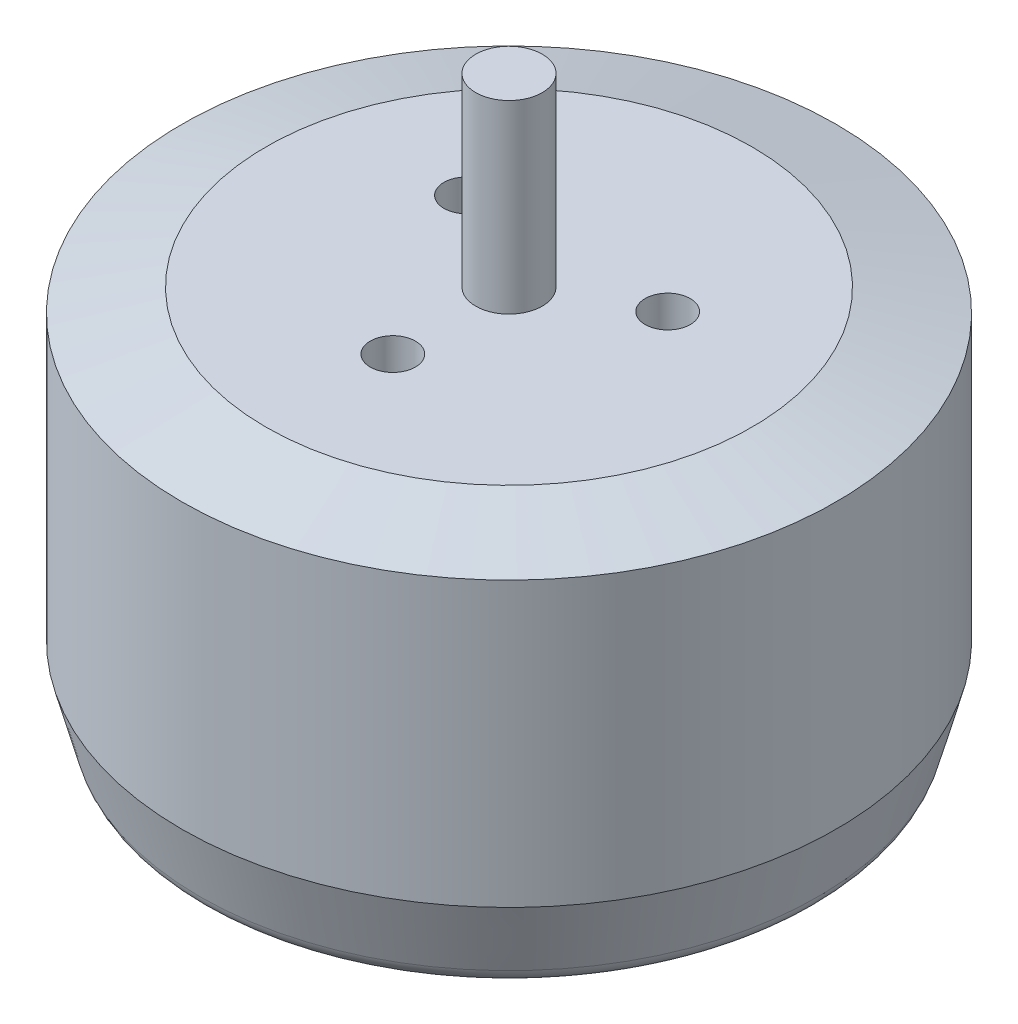
ISO-10303-21;
HEADER;
FILE_DESCRIPTION(('STEP AP214'),'2;1');
FILE_NAME('part.step','',(''),(''),'','','');
FILE_SCHEMA(('AUTOMOTIVE_DESIGN { 1 0 10303 214 1 1 1 1 }'));
ENDSEC;
DATA;
#1=APPLICATION_CONTEXT('core data for automotive mechanical design processes');
#2=APPLICATION_PROTOCOL_DEFINITION('international standard','automotive_design',2000,#1);
#3=PRODUCT_CONTEXT('',#1,'mechanical');
#4=PRODUCT('Part','Part','',(#3));
#5=PRODUCT_RELATED_PRODUCT_CATEGORY('part','',(#4));
#6=PRODUCT_DEFINITION_FORMATION('','',#4);
#7=PRODUCT_DEFINITION_CONTEXT('part definition',#1,'design');
#8=PRODUCT_DEFINITION('design','',#6,#7);
#9=PRODUCT_DEFINITION_SHAPE('','',#8);
#10=(LENGTH_UNIT() NAMED_UNIT(*) SI_UNIT(.MILLI.,.METRE.));
#11=(NAMED_UNIT(*) PLANE_ANGLE_UNIT() SI_UNIT($,.RADIAN.));
#12=(NAMED_UNIT(*) SI_UNIT($,.STERADIAN.) SOLID_ANGLE_UNIT());
#13=UNCERTAINTY_MEASURE_WITH_UNIT(LENGTH_MEASURE(1.E-05),#10,'distance_accuracy_value','');
#14=(GEOMETRIC_REPRESENTATION_CONTEXT(3) GLOBAL_UNCERTAINTY_ASSIGNED_CONTEXT((#13)) GLOBAL_UNIT_ASSIGNED_CONTEXT((#10,
#11,#12)) REPRESENTATION_CONTEXT('',''));
#15=CARTESIAN_POINT('',(0.,0.,0.));
#16=DIRECTION('',(0.,0.,1.));
#17=DIRECTION('',(1.,0.,0.));
#18=AXIS2_PLACEMENT_3D('',#15,#16,#17);
#19=CARTESIAN_POINT('',(0.,17.3,0.));
#20=DIRECTION('',(0.,-1.,0.));
#21=DIRECTION('',(0.,0.,-1.));
#22=AXIS2_PLACEMENT_3D('',#19,#20,#21);
#23=CYLINDRICAL_SURFACE('',#22,14.5);
#24=CARTESIAN_POINT('',(0.,16.3,0.));
#25=DIRECTION('',(0.,1.,0.));
#26=DIRECTION('',(0.,0.,1.));
#27=AXIS2_PLACEMENT_3D('',#24,#25,#26);
#28=CIRCLE('',#27,14.5);
#29=CARTESIAN_POINT('',(0.,16.3,14.5));
#30=VERTEX_POINT('',#29);
#31=EDGE_CURVE('E11',#30,#30,#28,.F.);
#32=ORIENTED_EDGE('',*,*,#31,.T.);
#33=EDGE_LOOP('',(#32));
#34=FACE_BOUND('',#33,.T.);
#35=CARTESIAN_POINT('',(0.,3.73205080756882,0.));
#36=DIRECTION('',(0.,1.,0.));
#37=DIRECTION('',(0.,0.,1.));
#38=AXIS2_PLACEMENT_3D('',#35,#36,#37);
#39=CIRCLE('',#38,14.5);
#40=CARTESIAN_POINT('',(0.,3.73205080756882,14.5));
#41=VERTEX_POINT('',#40);
#42=EDGE_CURVE('E121',#41,#41,#39,.T.);
#43=ORIENTED_EDGE('',*,*,#42,.T.);
#44=EDGE_LOOP('',(#43));
#45=FACE_BOUND('',#44,.T.);
#46=ADVANCED_FACE('F36',(#34,#45),#23,.T.);
#47=CARTESIAN_POINT('',(0.,17.3,0.));
#48=DIRECTION('',(0.,1.,0.));
#49=DIRECTION('',(0.,0.,1.));
#50=AXIS2_PLACEMENT_3D('',#47,#48,#49);
#51=PLANE('',#50);
#52=CARTESIAN_POINT('',(-4.46003082948985,17.3,-2.57500000000002));
#53=DIRECTION('',(0.,1.,0.));
#54=DIRECTION('',(0.,0.,1.));
#55=AXIS2_PLACEMENT_3D('',#52,#53,#54);
#56=CIRCLE('',#55,1.);
#57=CARTESIAN_POINT('',(-4.46003082948985,17.3,-1.57500000000002));
#58=VERTEX_POINT('',#57);
#59=EDGE_CURVE('E77',#58,#58,#56,.T.);
#60=ORIENTED_EDGE('',*,*,#59,.F.);
#61=EDGE_LOOP('',(#60));
#62=FACE_BOUND('',#61,.T.);
#63=CARTESIAN_POINT('',(4.46003082948985,17.3,-2.57500000000002));
#64=DIRECTION('',(0.,1.,0.));
#65=DIRECTION('',(0.,0.,1.));
#66=AXIS2_PLACEMENT_3D('',#63,#64,#65);
#67=CIRCLE('',#66,0.999999999999999);
#68=CARTESIAN_POINT('',(4.46003082948985,17.3,-1.57500000000002));
#69=VERTEX_POINT('',#68);
#70=EDGE_CURVE('E76',#69,#69,#67,.T.);
#71=ORIENTED_EDGE('',*,*,#70,.F.);
#72=EDGE_LOOP('',(#71));
#73=FACE_BOUND('',#72,.T.);
#74=CARTESIAN_POINT('',(0.,17.3,5.15));
#75=DIRECTION('',(0.,1.,0.));
#76=DIRECTION('',(0.,0.,1.));
#77=AXIS2_PLACEMENT_3D('',#74,#75,#76);
#78=CIRCLE('',#77,1.);
#79=CARTESIAN_POINT('',(0.,17.3,6.15));
#80=VERTEX_POINT('',#79);
#81=EDGE_CURVE('E87',#80,#80,#78,.T.);
#82=ORIENTED_EDGE('',*,*,#81,.F.);
#83=EDGE_LOOP('',(#82));
#84=FACE_BOUND('',#83,.T.);
#85=CARTESIAN_POINT('',(0.,17.3,0.));
#86=DIRECTION('',(0.,1.,0.));
#87=DIRECTION('',(0.,0.,1.));
#88=AXIS2_PLACEMENT_3D('',#85,#86,#87);
#89=CIRCLE('',#88,10.7679491924311);
#90=CARTESIAN_POINT('',(0.,17.3,10.7679491924311));
#91=VERTEX_POINT('',#90);
#92=EDGE_CURVE('E44',#91,#91,#89,.T.);
#93=ORIENTED_EDGE('',*,*,#92,.T.);
#94=EDGE_LOOP('',(#93));
#95=FACE_BOUND('',#94,.T.);
#96=CARTESIAN_POINT('',(0.,17.3,0.));
#97=DIRECTION('',(0.,1.,0.));
#98=DIRECTION('',(0.,0.,1.));
#99=AXIS2_PLACEMENT_3D('',#96,#97,#98);
#100=CIRCLE('',#99,1.475);
#101=CARTESIAN_POINT('',(0.,17.3,1.475));
#102=VERTEX_POINT('',#101);
#103=EDGE_CURVE('E117',#102,#102,#100,.T.);
#104=ORIENTED_EDGE('',*,*,#103,.F.);
#105=EDGE_LOOP('',(#104));
#106=FACE_BOUND('',#105,.T.);
#107=ADVANCED_FACE('F134',(#62,#73,#84,#95,#106),#51,.T.);
#108=CARTESIAN_POINT('',(0.,0.,0.));
#109=DIRECTION('',(0.,1.,0.));
#110=DIRECTION('',(0.,0.,1.));
#111=AXIS2_PLACEMENT_3D('',#108,#109,#110);
#112=PLANE('',#111);
#113=CARTESIAN_POINT('',(0.,0.,0.));
#114=DIRECTION('',(0.,1.,0.));
#115=DIRECTION('',(0.,0.,1.));
#116=AXIS2_PLACEMENT_3D('',#113,#114,#115);
#117=CIRCLE('',#116,12.732673012021);
#118=CARTESIAN_POINT('',(0.,0.,12.732673012021));
#119=VERTEX_POINT('',#118);
#120=EDGE_CURVE('E126',#119,#119,#117,.F.);
#121=ORIENTED_EDGE('',*,*,#120,.T.);
#122=EDGE_LOOP('',(#121));
#123=FACE_BOUND('',#122,.T.);
#124=CARTESIAN_POINT('',(0.,0.,8.));
#125=DIRECTION('',(0.,-1.,0.));
#126=DIRECTION('',(0.,0.,-1.));
#127=AXIS2_PLACEMENT_3D('',#124,#125,#126);
#128=CIRCLE('',#127,1.49999999999999);
#129=CARTESIAN_POINT('',(0.,0.,6.50000000000001));
#130=VERTEX_POINT('',#129);
#131=EDGE_CURVE('E93',#130,#130,#128,.T.);
#132=ORIENTED_EDGE('',*,*,#131,.F.);
#133=EDGE_LOOP('',(#132));
#134=FACE_BOUND('',#133,.T.);
#135=CARTESIAN_POINT('',(-9.5,0.,0.));
#136=DIRECTION('',(0.,-1.,0.));
#137=DIRECTION('',(0.,0.,-1.));
#138=AXIS2_PLACEMENT_3D('',#135,#136,#137);
#139=CIRCLE('',#138,1.49999999999999);
#140=CARTESIAN_POINT('',(-9.5,0.,-1.49999999999999));
#141=VERTEX_POINT('',#140);
#142=EDGE_CURVE('E99',#141,#141,#139,.T.);
#143=ORIENTED_EDGE('',*,*,#142,.F.);
#144=EDGE_LOOP('',(#143));
#145=FACE_BOUND('',#144,.T.);
#146=CARTESIAN_POINT('',(0.,0.,-8.00063569577454));
#147=DIRECTION('',(0.,-1.,0.));
#148=DIRECTION('',(0.,0.,-1.));
#149=AXIS2_PLACEMENT_3D('',#146,#147,#148);
#150=CIRCLE('',#149,1.49999999999999);
#151=CARTESIAN_POINT('',(0.,0.,-9.50063569577453));
#152=VERTEX_POINT('',#151);
#153=EDGE_CURVE('E105',#152,#152,#150,.T.);
#154=ORIENTED_EDGE('',*,*,#153,.F.);
#155=EDGE_LOOP('',(#154));
#156=FACE_BOUND('',#155,.T.);
#157=CARTESIAN_POINT('',(9.5,0.,0.));
#158=DIRECTION('',(0.,-1.,0.));
#159=DIRECTION('',(0.,0.,-1.));
#160=AXIS2_PLACEMENT_3D('',#157,#158,#159);
#161=CIRCLE('',#160,1.49999999999999);
#162=CARTESIAN_POINT('',(9.5,0.,-1.49999999999999));
#163=VERTEX_POINT('',#162);
#164=EDGE_CURVE('E111',#163,#163,#161,.T.);
#165=ORIENTED_EDGE('',*,*,#164,.F.);
#166=EDGE_LOOP('',(#165));
#167=FACE_BOUND('',#166,.T.);
#168=ADVANCED_FACE('F157',(#123,#134,#145,#156,#167),#112,.F.);
#169=CARTESIAN_POINT('',(0.,25.5,0.));
#170=DIRECTION('',(0.,-1.,0.));
#171=DIRECTION('',(0.,0.,-1.));
#172=AXIS2_PLACEMENT_3D('',#169,#170,#171);
#173=CYLINDRICAL_SURFACE('',#172,1.475);
#174=CARTESIAN_POINT('',(0.,25.5,0.));
#175=DIRECTION('',(0.,1.,0.));
#176=DIRECTION('',(0.,0.,1.));
#177=AXIS2_PLACEMENT_3D('',#174,#175,#176);
#178=CIRCLE('',#177,1.475);
#179=CARTESIAN_POINT('',(0.,25.5,1.475));
#180=VERTEX_POINT('',#179);
#181=EDGE_CURVE('E118',#180,#180,#178,.T.);
#182=ORIENTED_EDGE('',*,*,#181,.F.);
#183=EDGE_LOOP('',(#182));
#184=FACE_BOUND('',#183,.T.);
#185=ORIENTED_EDGE('',*,*,#103,.T.);
#186=EDGE_LOOP('',(#185));
#187=FACE_BOUND('',#186,.T.);
#188=ADVANCED_FACE('F180',(#184,#187),#173,.T.);
#189=CARTESIAN_POINT('',(0.,25.5,0.));
#190=DIRECTION('',(0.,1.,0.));
#191=DIRECTION('',(0.,0.,1.));
#192=AXIS2_PLACEMENT_3D('',#189,#190,#191);
#193=PLANE('',#192);
#194=ORIENTED_EDGE('',*,*,#181,.T.);
#195=EDGE_LOOP('',(#194));
#196=FACE_BOUND('',#195,.T.);
#197=ADVANCED_FACE('F201',(#196),#193,.T.);
#198=CARTESIAN_POINT('',(9.5,3.,0.));
#199=DIRECTION('',(0.,-1.,0.));
#200=DIRECTION('',(0.,0.,-1.));
#201=AXIS2_PLACEMENT_3D('',#198,#199,#200);
#202=CONICAL_SURFACE('',#201,1.49999999999999,1.02974425867665);
#203=CARTESIAN_POINT('',(9.5,3.90129092854134,0.));
#204=VERTEX_POINT('',#203);
#205=VERTEX_LOOP('',#204);
#206=FACE_BOUND('',#205,.T.);
#207=CARTESIAN_POINT('',(9.5,3.,0.));
#208=DIRECTION('',(0.,-1.,0.));
#209=DIRECTION('',(0.,0.,-1.));
#210=AXIS2_PLACEMENT_3D('',#207,#208,#209);
#211=CIRCLE('',#210,1.49999999999999);
#212=CARTESIAN_POINT('',(9.5,3.,-1.49999999999999));
#213=VERTEX_POINT('',#212);
#214=EDGE_CURVE('E114',#213,#213,#211,.T.);
#215=ORIENTED_EDGE('',*,*,#214,.T.);
#216=EDGE_LOOP('',(#215));
#217=FACE_BOUND('',#216,.T.);
#218=ADVANCED_FACE('F192',(#206,#217),#202,.F.);
#219=CARTESIAN_POINT('',(9.5,0.,0.));
#220=DIRECTION('',(0.,-1.,0.));
#221=DIRECTION('',(0.,0.,-1.));
#222=AXIS2_PLACEMENT_3D('',#219,#220,#221);
#223=CYLINDRICAL_SURFACE('',#222,1.49999999999999);
#224=ORIENTED_EDGE('',*,*,#214,.F.);
#225=EDGE_LOOP('',(#224));
#226=FACE_BOUND('',#225,.T.);
#227=ORIENTED_EDGE('',*,*,#164,.T.);
#228=EDGE_LOOP('',(#227));
#229=FACE_BOUND('',#228,.T.);
#230=ADVANCED_FACE('F189',(#226,#229),#223,.F.);
#231=CARTESIAN_POINT('',(0.,3.,-8.00063569577454));
#232=DIRECTION('',(0.,-1.,0.));
#233=DIRECTION('',(0.,0.,-1.));
#234=AXIS2_PLACEMENT_3D('',#231,#232,#233);
#235=CONICAL_SURFACE('',#234,1.49999999999999,1.02974425867665);
#236=CARTESIAN_POINT('',(0.,3.90129092854134,-8.00063569577454));
#237=VERTEX_POINT('',#236);
#238=VERTEX_LOOP('',#237);
#239=FACE_BOUND('',#238,.T.);
#240=CARTESIAN_POINT('',(0.,3.,-8.00063569577454));
#241=DIRECTION('',(0.,-1.,0.));
#242=DIRECTION('',(0.,0.,-1.));
#243=AXIS2_PLACEMENT_3D('',#240,#241,#242);
#244=CIRCLE('',#243,1.49999999999999);
#245=CARTESIAN_POINT('',(0.,3.,-9.50063569577453));
#246=VERTEX_POINT('',#245);
#247=EDGE_CURVE('E108',#246,#246,#244,.T.);
#248=ORIENTED_EDGE('',*,*,#247,.T.);
#249=EDGE_LOOP('',(#248));
#250=FACE_BOUND('',#249,.T.);
#251=ADVANCED_FACE('F191',(#239,#250),#235,.F.);
#252=CARTESIAN_POINT('',(0.,0.,-8.00063569577454));
#253=DIRECTION('',(0.,-1.,0.));
#254=DIRECTION('',(0.,0.,-1.));
#255=AXIS2_PLACEMENT_3D('',#252,#253,#254);
#256=CYLINDRICAL_SURFACE('',#255,1.49999999999999);
#257=ORIENTED_EDGE('',*,*,#247,.F.);
#258=EDGE_LOOP('',(#257));
#259=FACE_BOUND('',#258,.T.);
#260=ORIENTED_EDGE('',*,*,#153,.T.);
#261=EDGE_LOOP('',(#260));
#262=FACE_BOUND('',#261,.T.);
#263=ADVANCED_FACE('F199',(#259,#262),#256,.F.);
#264=CARTESIAN_POINT('',(-9.5,3.,0.));
#265=DIRECTION('',(0.,-1.,0.));
#266=DIRECTION('',(0.,0.,-1.));
#267=AXIS2_PLACEMENT_3D('',#264,#265,#266);
#268=CONICAL_SURFACE('',#267,1.49999999999999,1.02974425867665);
#269=CARTESIAN_POINT('',(-9.5,3.90129092854134,0.));
#270=VERTEX_POINT('',#269);
#271=VERTEX_LOOP('',#270);
#272=FACE_BOUND('',#271,.T.);
#273=CARTESIAN_POINT('',(-9.5,3.,0.));
#274=DIRECTION('',(0.,-1.,0.));
#275=DIRECTION('',(0.,0.,-1.));
#276=AXIS2_PLACEMENT_3D('',#273,#274,#275);
#277=CIRCLE('',#276,1.49999999999999);
#278=CARTESIAN_POINT('',(-9.5,3.,-1.49999999999999));
#279=VERTEX_POINT('',#278);
#280=EDGE_CURVE('E102',#279,#279,#277,.T.);
#281=ORIENTED_EDGE('',*,*,#280,.T.);
#282=EDGE_LOOP('',(#281));
#283=FACE_BOUND('',#282,.T.);
#284=ADVANCED_FACE('F241',(#272,#283),#268,.F.);
#285=CARTESIAN_POINT('',(-9.5,0.,0.));
#286=DIRECTION('',(0.,-1.,0.));
#287=DIRECTION('',(0.,0.,-1.));
#288=AXIS2_PLACEMENT_3D('',#285,#286,#287);
#289=CYLINDRICAL_SURFACE('',#288,1.49999999999999);
#290=ORIENTED_EDGE('',*,*,#280,.F.);
#291=EDGE_LOOP('',(#290));
#292=FACE_BOUND('',#291,.T.);
#293=ORIENTED_EDGE('',*,*,#142,.T.);
#294=EDGE_LOOP('',(#293));
#295=FACE_BOUND('',#294,.T.);
#296=ADVANCED_FACE('F246',(#292,#295),#289,.F.);
#297=CARTESIAN_POINT('',(0.,3.,8.));
#298=DIRECTION('',(0.,-1.,0.));
#299=DIRECTION('',(0.,0.,-1.));
#300=AXIS2_PLACEMENT_3D('',#297,#298,#299);
#301=CONICAL_SURFACE('',#300,1.49999999999999,1.02974425867665);
#302=CARTESIAN_POINT('',(0.,3.90129092854134,8.));
#303=VERTEX_POINT('',#302);
#304=VERTEX_LOOP('',#303);
#305=FACE_BOUND('',#304,.T.);
#306=CARTESIAN_POINT('',(0.,3.,8.));
#307=DIRECTION('',(0.,-1.,0.));
#308=DIRECTION('',(0.,0.,-1.));
#309=AXIS2_PLACEMENT_3D('',#306,#307,#308);
#310=CIRCLE('',#309,1.49999999999999);
#311=CARTESIAN_POINT('',(0.,3.,6.50000000000001));
#312=VERTEX_POINT('',#311);
#313=EDGE_CURVE('E96',#312,#312,#310,.T.);
#314=ORIENTED_EDGE('',*,*,#313,.T.);
#315=EDGE_LOOP('',(#314));
#316=FACE_BOUND('',#315,.T.);
#317=ADVANCED_FACE('F169',(#305,#316),#301,.F.);
#318=CARTESIAN_POINT('',(0.,0.,8.));
#319=DIRECTION('',(0.,-1.,0.));
#320=DIRECTION('',(0.,0.,-1.));
#321=AXIS2_PLACEMENT_3D('',#318,#319,#320);
#322=CYLINDRICAL_SURFACE('',#321,1.49999999999999);
#323=ORIENTED_EDGE('',*,*,#313,.F.);
#324=EDGE_LOOP('',(#323));
#325=FACE_BOUND('',#324,.T.);
#326=ORIENTED_EDGE('',*,*,#131,.T.);
#327=EDGE_LOOP('',(#326));
#328=FACE_BOUND('',#327,.T.);
#329=ADVANCED_FACE('F164',(#325,#328),#322,.F.);
#330=CARTESIAN_POINT('',(0.,3.73205080756882,0.));
#331=DIRECTION('',(0.,1.,0.));
#332=DIRECTION('',(0.,0.,1.));
#333=AXIS2_PLACEMENT_3D('',#330,#331,#332);
#334=CONICAL_SURFACE('',#333,14.5,0.261799387799151);
#335=CARTESIAN_POINT('',(0.,0.741180954897477,0.));
#336=DIRECTION('',(0.,1.,0.));
#337=DIRECTION('',(0.,0.,1.));
#338=AXIS2_PLACEMENT_3D('',#335,#336,#337);
#339=CIRCLE('',#338,13.6985988383101);
#340=CARTESIAN_POINT('',(0.,0.741180954897477,13.6985988383101));
#341=VERTEX_POINT('',#340);
#342=EDGE_CURVE('E129',#341,#341,#339,.T.);
#343=ORIENTED_EDGE('',*,*,#342,.T.);
#344=EDGE_LOOP('',(#343));
#345=FACE_BOUND('',#344,.T.);
#346=ORIENTED_EDGE('',*,*,#42,.F.);
#347=EDGE_LOOP('',(#346));
#348=FACE_BOUND('',#347,.T.);
#349=ADVANCED_FACE('F148',(#345,#348),#334,.T.);
#350=CARTESIAN_POINT('',(0.,1.,0.));
#351=DIRECTION('',(0.,1.,0.));
#352=DIRECTION('',(0.,0.,1.));
#353=AXIS2_PLACEMENT_3D('',#350,#351,#352);
#354=TOROIDAL_SURFACE('',#353,12.732673012021,1.);
#355=ORIENTED_EDGE('',*,*,#342,.F.);
#356=EDGE_LOOP('',(#355));
#357=FACE_BOUND('',#356,.T.);
#358=ORIENTED_EDGE('',*,*,#120,.F.);
#359=EDGE_LOOP('',(#358));
#360=FACE_BOUND('',#359,.T.);
#361=ADVANCED_FACE('F139',(#357,#360),#354,.T.);
#362=CARTESIAN_POINT('',(0.,17.3,0.));
#363=DIRECTION('',(0.,-1.,0.));
#364=DIRECTION('',(0.,0.,-1.));
#365=AXIS2_PLACEMENT_3D('',#362,#363,#364);
#366=CONICAL_SURFACE('',#365,10.7679491924311,1.30899693899575);
#367=ORIENTED_EDGE('',*,*,#31,.F.);
#368=EDGE_LOOP('',(#367));
#369=FACE_BOUND('',#368,.T.);
#370=ORIENTED_EDGE('',*,*,#92,.F.);
#371=EDGE_LOOP('',(#370));
#372=FACE_BOUND('',#371,.T.);
#373=ADVANCED_FACE('F38',(#369,#372),#366,.T.);
#374=CARTESIAN_POINT('',(0.,14.3,5.15));
#375=DIRECTION('',(0.,1.,0.));
#376=DIRECTION('',(0.,0.,1.));
#377=AXIS2_PLACEMENT_3D('',#374,#375,#376);
#378=CONICAL_SURFACE('',#377,0.999999999999999,1.02974425867665);
#379=CARTESIAN_POINT('',(0.,13.6991393809724,5.15));
#380=VERTEX_POINT('',#379);
#381=VERTEX_LOOP('',#380);
#382=FACE_BOUND('',#381,.T.);
#383=CARTESIAN_POINT('',(0.,14.3,5.15));
#384=DIRECTION('',(0.,1.,0.));
#385=DIRECTION('',(0.,0.,1.));
#386=AXIS2_PLACEMENT_3D('',#383,#384,#385);
#387=CIRCLE('',#386,0.999999999999999);
#388=CARTESIAN_POINT('',(0.,14.3,6.15));
#389=VERTEX_POINT('',#388);
#390=EDGE_CURVE('E90',#389,#389,#387,.T.);
#391=ORIENTED_EDGE('',*,*,#390,.T.);
#392=EDGE_LOOP('',(#391));
#393=FACE_BOUND('',#392,.T.);
#394=ADVANCED_FACE('F138',(#382,#393),#378,.F.);
#395=CARTESIAN_POINT('',(0.,17.3,5.15));
#396=DIRECTION('',(0.,1.,0.));
#397=DIRECTION('',(0.,0.,1.));
#398=AXIS2_PLACEMENT_3D('',#395,#396,#397);
#399=CYLINDRICAL_SURFACE('',#398,0.999999999999999);
#400=ORIENTED_EDGE('',*,*,#390,.F.);
#401=EDGE_LOOP('',(#400));
#402=FACE_BOUND('',#401,.T.);
#403=ORIENTED_EDGE('',*,*,#81,.T.);
#404=EDGE_LOOP('',(#403));
#405=FACE_BOUND('',#404,.T.);
#406=ADVANCED_FACE('F145',(#402,#405),#399,.F.);
#407=CARTESIAN_POINT('',(4.46003082948985,14.3,-2.57500000000002));
#408=DIRECTION('',(0.,1.,0.));
#409=DIRECTION('',(0.,0.,1.));
#410=AXIS2_PLACEMENT_3D('',#407,#408,#409);
#411=CONICAL_SURFACE('',#410,0.999999999999999,1.02974425867665);
#412=CARTESIAN_POINT('',(4.46003082948985,13.6991393809724,-2.57500000000002));
#413=VERTEX_POINT('',#412);
#414=VERTEX_LOOP('',#413);
#415=FACE_BOUND('',#414,.T.);
#416=CARTESIAN_POINT('',(4.46003082948985,14.3,-2.57500000000002));
#417=DIRECTION('',(0.,1.,0.));
#418=DIRECTION('',(0.,0.,1.));
#419=AXIS2_PLACEMENT_3D('',#416,#417,#418);
#420=CIRCLE('',#419,0.999999999999999);
#421=CARTESIAN_POINT('',(4.46003082948985,14.3,-1.57500000000002));
#422=VERTEX_POINT('',#421);
#423=EDGE_CURVE('E80',#422,#422,#420,.T.);
#424=ORIENTED_EDGE('',*,*,#423,.T.);
#425=EDGE_LOOP('',(#424));
#426=FACE_BOUND('',#425,.T.);
#427=ADVANCED_FACE('F318',(#415,#426),#411,.F.);
#428=CARTESIAN_POINT('',(4.46003082948985,17.3,-2.57500000000002));
#429=DIRECTION('',(0.,1.,0.));
#430=DIRECTION('',(0.,0.,1.));
#431=AXIS2_PLACEMENT_3D('',#428,#429,#430);
#432=CYLINDRICAL_SURFACE('',#431,0.999999999999999);
#433=ORIENTED_EDGE('',*,*,#423,.F.);
#434=EDGE_LOOP('',(#433));
#435=FACE_BOUND('',#434,.T.);
#436=ORIENTED_EDGE('',*,*,#70,.T.);
#437=EDGE_LOOP('',(#436));
#438=FACE_BOUND('',#437,.T.);
#439=ADVANCED_FACE('F70',(#435,#438),#432,.F.);
#440=CARTESIAN_POINT('',(-4.46003082948985,14.3,-2.57500000000002));
#441=DIRECTION('',(0.,1.,0.));
#442=DIRECTION('',(0.,0.,1.));
#443=AXIS2_PLACEMENT_3D('',#440,#441,#442);
#444=CONICAL_SURFACE('',#443,0.999999999999999,1.02974425867665);
#445=CARTESIAN_POINT('',(-4.46003082948985,13.6991393809724,-2.57500000000002));
#446=VERTEX_POINT('',#445);
#447=VERTEX_LOOP('',#446);
#448=FACE_BOUND('',#447,.T.);
#449=CARTESIAN_POINT('',(-4.46003082948985,14.3,-2.57500000000002));
#450=DIRECTION('',(0.,1.,0.));
#451=DIRECTION('',(0.,0.,1.));
#452=AXIS2_PLACEMENT_3D('',#449,#450,#451);
#453=CIRCLE('',#452,0.999999999999999);
#454=CARTESIAN_POINT('',(-4.46003082948985,14.3,-1.57500000000002));
#455=VERTEX_POINT('',#454);
#456=EDGE_CURVE('E74',#455,#455,#453,.T.);
#457=ORIENTED_EDGE('',*,*,#456,.T.);
#458=EDGE_LOOP('',(#457));
#459=FACE_BOUND('',#458,.T.);
#460=ADVANCED_FACE('F66',(#448,#459),#444,.F.);
#461=CARTESIAN_POINT('',(-4.46003082948985,17.3,-2.57500000000002));
#462=DIRECTION('',(0.,1.,0.));
#463=DIRECTION('',(0.,0.,1.));
#464=AXIS2_PLACEMENT_3D('',#461,#462,#463);
#465=CYLINDRICAL_SURFACE('',#464,0.999999999999999);
#466=ORIENTED_EDGE('',*,*,#456,.F.);
#467=EDGE_LOOP('',(#466));
#468=FACE_BOUND('',#467,.T.);
#469=ORIENTED_EDGE('',*,*,#59,.T.);
#470=EDGE_LOOP('',(#469));
#471=FACE_BOUND('',#470,.T.);
#472=ADVANCED_FACE('F69',(#468,#471),#465,.F.);
#473=CLOSED_SHELL('',(#46,#107,#168,#188,#197,#218,#230,#251,#263,#284,#296,#317,#329,#349,#361,
#373,#394,#406,#427,#439,#460,#472));
#474=MANIFOLD_SOLID_BREP('B2',#473);
#475=ADVANCED_BREP_SHAPE_REPRESENTATION('',(#18,#474),#14);
#476=SHAPE_DEFINITION_REPRESENTATION(#9,#475);
ENDSEC;
END-ISO-10303-21;
